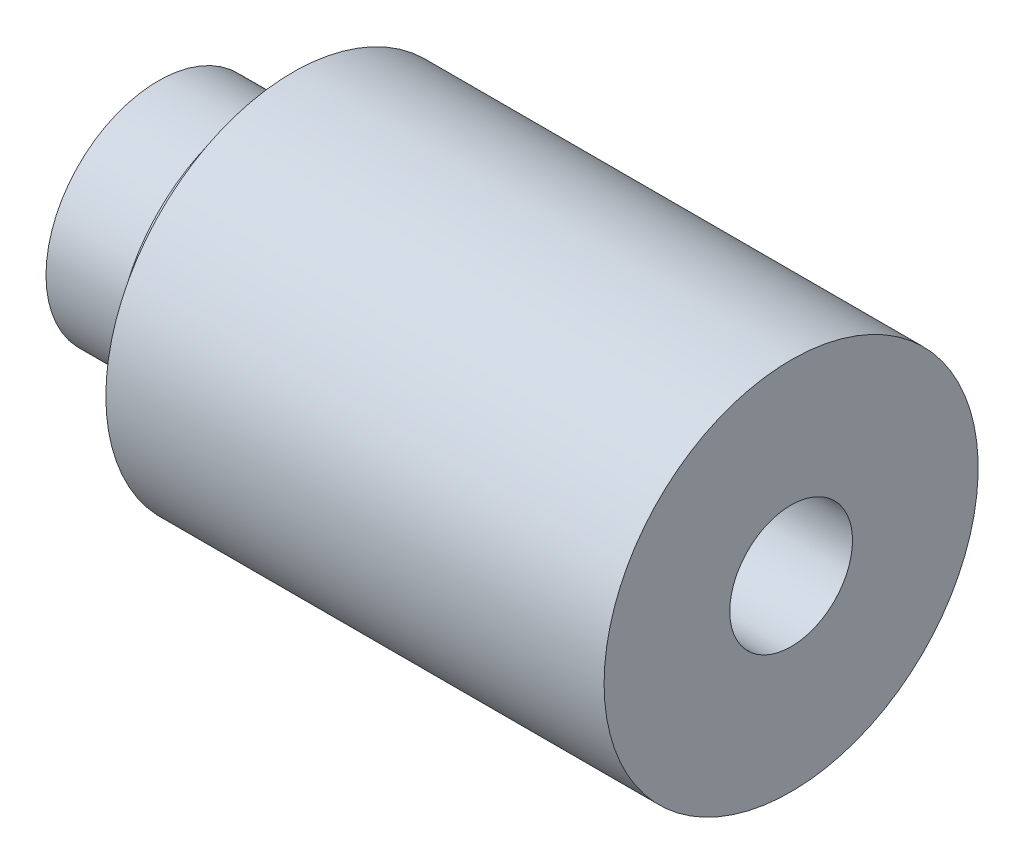
ISO-10303-21;
HEADER;
FILE_DESCRIPTION(('STEP AP214'),'2;1');
FILE_NAME('part.step','',(''),(''),'','','');
FILE_SCHEMA(('AUTOMOTIVE_DESIGN { 1 0 10303 214 1 1 1 1 }'));
ENDSEC;
DATA;
#1=APPLICATION_CONTEXT('core data for automotive mechanical design processes');
#2=APPLICATION_PROTOCOL_DEFINITION('international standard','automotive_design',2000,#1);
#3=PRODUCT_CONTEXT('',#1,'mechanical');
#4=PRODUCT('Part','Part','',(#3));
#5=PRODUCT_RELATED_PRODUCT_CATEGORY('part','',(#4));
#6=PRODUCT_DEFINITION_FORMATION('','',#4);
#7=PRODUCT_DEFINITION_CONTEXT('part definition',#1,'design');
#8=PRODUCT_DEFINITION('design','',#6,#7);
#9=PRODUCT_DEFINITION_SHAPE('','',#8);
#10=(LENGTH_UNIT() NAMED_UNIT(*) SI_UNIT(.MILLI.,.METRE.));
#11=(NAMED_UNIT(*) PLANE_ANGLE_UNIT() SI_UNIT($,.RADIAN.));
#12=(NAMED_UNIT(*) SI_UNIT($,.STERADIAN.) SOLID_ANGLE_UNIT());
#13=UNCERTAINTY_MEASURE_WITH_UNIT(LENGTH_MEASURE(1.E-05),#10,'distance_accuracy_value','');
#14=(GEOMETRIC_REPRESENTATION_CONTEXT(3) GLOBAL_UNCERTAINTY_ASSIGNED_CONTEXT((#13)) GLOBAL_UNIT_ASSIGNED_CONTEXT((#10,
#11,#12)) REPRESENTATION_CONTEXT('',''));
#15=CARTESIAN_POINT('',(0.,0.,0.));
#16=DIRECTION('',(0.,0.,1.));
#17=DIRECTION('',(1.,0.,0.));
#18=AXIS2_PLACEMENT_3D('',#15,#16,#17);
#19=CARTESIAN_POINT('',(1.2,0.,0.));
#20=DIRECTION('',(1.,0.,0.));
#21=DIRECTION('',(0.,0.,-1.));
#22=AXIS2_PLACEMENT_3D('',#19,#20,#21);
#23=PLANE('',#22);
#24=CARTESIAN_POINT('',(1.2,0.,0.));
#25=DIRECTION('',(-1.,0.,0.));
#26=DIRECTION('',(0.,0.,1.));
#27=AXIS2_PLACEMENT_3D('',#24,#25,#26);
#28=CIRCLE('',#27,4.09999999999999);
#29=CARTESIAN_POINT('',(1.2,0.,4.09999999999999));
#30=VERTEX_POINT('',#29);
#31=EDGE_CURVE('E59',#30,#30,#28,.T.);
#32=ORIENTED_EDGE('',*,*,#31,.F.);
#33=EDGE_LOOP('',(#32));
#34=FACE_BOUND('',#33,.T.);
#35=CARTESIAN_POINT('',(1.20000000000009,0.,0.));
#36=DIRECTION('',(-1.,0.,0.));
#37=DIRECTION('',(0.,0.,1.));
#38=AXIS2_PLACEMENT_3D('',#35,#36,#37);
#39=CIRCLE('',#38,7.49999999999994);
#40=CARTESIAN_POINT('',(1.20000000000009,0.,7.49999999999994));
#41=VERTEX_POINT('',#40);
#42=EDGE_CURVE('E10',#41,#41,#39,.T.);
#43=ORIENTED_EDGE('',*,*,#42,.T.);
#44=EDGE_LOOP('',(#43));
#45=FACE_BOUND('',#44,.T.);
#46=ADVANCED_FACE('F31',(#34,#45),#23,.F.);
#47=CARTESIAN_POINT('',(-1000.,0.,0.));
#48=DIRECTION('',(-1.,0.,0.));
#49=DIRECTION('',(0.,0.,1.));
#50=AXIS2_PLACEMENT_3D('',#47,#48,#49);
#51=CYLINDRICAL_SURFACE('',#50,7.49999999999994);
#52=ORIENTED_EDGE('',*,*,#42,.F.);
#53=EDGE_LOOP('',(#52));
#54=FACE_BOUND('',#53,.T.);
#55=CARTESIAN_POINT('',(8.19999999999999,0.,0.));
#56=DIRECTION('',(-1.,0.,0.));
#57=DIRECTION('',(0.,0.,1.));
#58=AXIS2_PLACEMENT_3D('',#55,#56,#57);
#59=CIRCLE('',#58,7.49999999999994);
#60=CARTESIAN_POINT('',(8.19999999999999,0.,7.49999999999994));
#61=VERTEX_POINT('',#60);
#62=EDGE_CURVE('E37',#61,#61,#59,.T.);
#63=ORIENTED_EDGE('',*,*,#62,.T.);
#64=EDGE_LOOP('',(#63));
#65=FACE_BOUND('',#64,.T.);
#66=ADVANCED_FACE('F66',(#54,#65),#51,.T.);
#67=CARTESIAN_POINT('',(8.2,7.49999999999994,0.));
#68=DIRECTION('',(1.,0.,0.));
#69=DIRECTION('',(0.,0.,-1.));
#70=AXIS2_PLACEMENT_3D('',#67,#68,#69);
#71=PLANE('',#70);
#72=ORIENTED_EDGE('',*,*,#62,.F.);
#73=EDGE_LOOP('',(#72));
#74=FACE_BOUND('',#73,.T.);
#75=CARTESIAN_POINT('',(8.19999999999999,0.,0.));
#76=DIRECTION('',(-1.,0.,0.));
#77=DIRECTION('',(0.,0.,1.));
#78=AXIS2_PLACEMENT_3D('',#75,#76,#77);
#79=CIRCLE('',#78,9.83333333333328);
#80=CARTESIAN_POINT('',(8.19999999999999,0.,9.83333333333328));
#81=VERTEX_POINT('',#80);
#82=EDGE_CURVE('E41',#81,#81,#79,.T.);
#83=ORIENTED_EDGE('',*,*,#82,.T.);
#84=EDGE_LOOP('',(#83));
#85=FACE_BOUND('',#84,.T.);
#86=ADVANCED_FACE('F70',(#74,#85),#71,.F.);
#87=CARTESIAN_POINT('',(-1000.,0.,0.));
#88=DIRECTION('',(-1.,0.,0.));
#89=DIRECTION('',(0.,0.,1.));
#90=AXIS2_PLACEMENT_3D('',#87,#88,#89);
#91=CYLINDRICAL_SURFACE('',#90,9.83333333333328);
#92=ORIENTED_EDGE('',*,*,#82,.F.);
#93=EDGE_LOOP('',(#92));
#94=FACE_BOUND('',#93,.T.);
#95=CARTESIAN_POINT('',(10.2,0.,0.));
#96=DIRECTION('',(-1.,0.,0.));
#97=DIRECTION('',(0.,0.,1.));
#98=AXIS2_PLACEMENT_3D('',#95,#96,#97);
#99=CIRCLE('',#98,9.83333333333328);
#100=CARTESIAN_POINT('',(10.2,0.,9.83333333333328));
#101=VERTEX_POINT('',#100);
#102=EDGE_CURVE('E45',#101,#101,#99,.T.);
#103=ORIENTED_EDGE('',*,*,#102,.T.);
#104=EDGE_LOOP('',(#103));
#105=FACE_BOUND('',#104,.T.);
#106=ADVANCED_FACE('F75',(#94,#105),#91,.T.);
#107=CARTESIAN_POINT('',(10.2,9.83333333333328,0.));
#108=DIRECTION('',(1.,0.,0.));
#109=DIRECTION('',(0.,0.,-1.));
#110=AXIS2_PLACEMENT_3D('',#107,#108,#109);
#111=PLANE('',#110);
#112=ORIENTED_EDGE('',*,*,#102,.F.);
#113=EDGE_LOOP('',(#112));
#114=FACE_BOUND('',#113,.T.);
#115=CARTESIAN_POINT('',(10.2,0.,0.));
#116=DIRECTION('',(-1.,0.,0.));
#117=DIRECTION('',(0.,0.,1.));
#118=AXIS2_PLACEMENT_3D('',#115,#116,#117);
#119=CIRCLE('',#118,12.5);
#120=CARTESIAN_POINT('',(10.2,0.,12.5));
#121=VERTEX_POINT('',#120);
#122=EDGE_CURVE('E50',#121,#121,#119,.T.);
#123=ORIENTED_EDGE('',*,*,#122,.T.);
#124=EDGE_LOOP('',(#123));
#125=FACE_BOUND('',#124,.T.);
#126=ADVANCED_FACE('F81',(#114,#125),#111,.F.);
#127=CARTESIAN_POINT('',(-1000.,0.,0.));
#128=DIRECTION('',(-1.,0.,0.));
#129=DIRECTION('',(0.,0.,1.));
#130=AXIS2_PLACEMENT_3D('',#127,#128,#129);
#131=CYLINDRICAL_SURFACE('',#130,12.5);
#132=ORIENTED_EDGE('',*,*,#122,.F.);
#133=EDGE_LOOP('',(#132));
#134=FACE_BOUND('',#133,.T.);
#135=CARTESIAN_POINT('',(43.5000000000001,0.,0.));
#136=DIRECTION('',(-1.,0.,0.));
#137=DIRECTION('',(0.,0.,1.));
#138=AXIS2_PLACEMENT_3D('',#135,#136,#137);
#139=CIRCLE('',#138,12.5);
#140=CARTESIAN_POINT('',(43.5000000000001,0.,12.5));
#141=VERTEX_POINT('',#140);
#142=EDGE_CURVE('E53',#141,#141,#139,.T.);
#143=ORIENTED_EDGE('',*,*,#142,.T.);
#144=EDGE_LOOP('',(#143));
#145=FACE_BOUND('',#144,.T.);
#146=ADVANCED_FACE('F85',(#134,#145),#131,.T.);
#147=CARTESIAN_POINT('',(43.5000000000002,12.5,0.));
#148=DIRECTION('',(-1.,0.,0.));
#149=DIRECTION('',(0.,0.,1.));
#150=AXIS2_PLACEMENT_3D('',#147,#148,#149);
#151=PLANE('',#150);
#152=CARTESIAN_POINT('',(43.5000000000001,0.,0.));
#153=DIRECTION('',(-1.,0.,0.));
#154=DIRECTION('',(0.,0.,1.));
#155=AXIS2_PLACEMENT_3D('',#152,#153,#154);
#156=CIRCLE('',#155,4.09999999999999);
#157=CARTESIAN_POINT('',(43.5000000000001,0.,4.09999999999999));
#158=VERTEX_POINT('',#157);
#159=EDGE_CURVE('E56',#158,#158,#156,.T.);
#160=ORIENTED_EDGE('',*,*,#159,.T.);
#161=EDGE_LOOP('',(#160));
#162=FACE_BOUND('',#161,.T.);
#163=ORIENTED_EDGE('',*,*,#142,.F.);
#164=EDGE_LOOP('',(#163));
#165=FACE_BOUND('',#164,.T.);
#166=ADVANCED_FACE('F89',(#162,#165),#151,.F.);
#167=CARTESIAN_POINT('',(1.2,0.,0.));
#168=DIRECTION('',(-1.,0.,0.));
#169=DIRECTION('',(0.,0.,1.));
#170=AXIS2_PLACEMENT_3D('',#167,#168,#169);
#171=CYLINDRICAL_SURFACE('',#170,4.09999999999999);
#172=ORIENTED_EDGE('',*,*,#159,.F.);
#173=EDGE_LOOP('',(#172));
#174=FACE_BOUND('',#173,.T.);
#175=ORIENTED_EDGE('',*,*,#31,.T.);
#176=EDGE_LOOP('',(#175));
#177=FACE_BOUND('',#176,.T.);
#178=ADVANCED_FACE('F63',(#174,#177),#171,.F.);
#179=CLOSED_SHELL('',(#46,#66,#86,#106,#126,#146,#166,#178));
#180=MANIFOLD_SOLID_BREP('B2',#179);
#181=ADVANCED_BREP_SHAPE_REPRESENTATION('',(#18,#180),#14);
#182=SHAPE_DEFINITION_REPRESENTATION(#9,#181);
ENDSEC;
END-ISO-10303-21;
